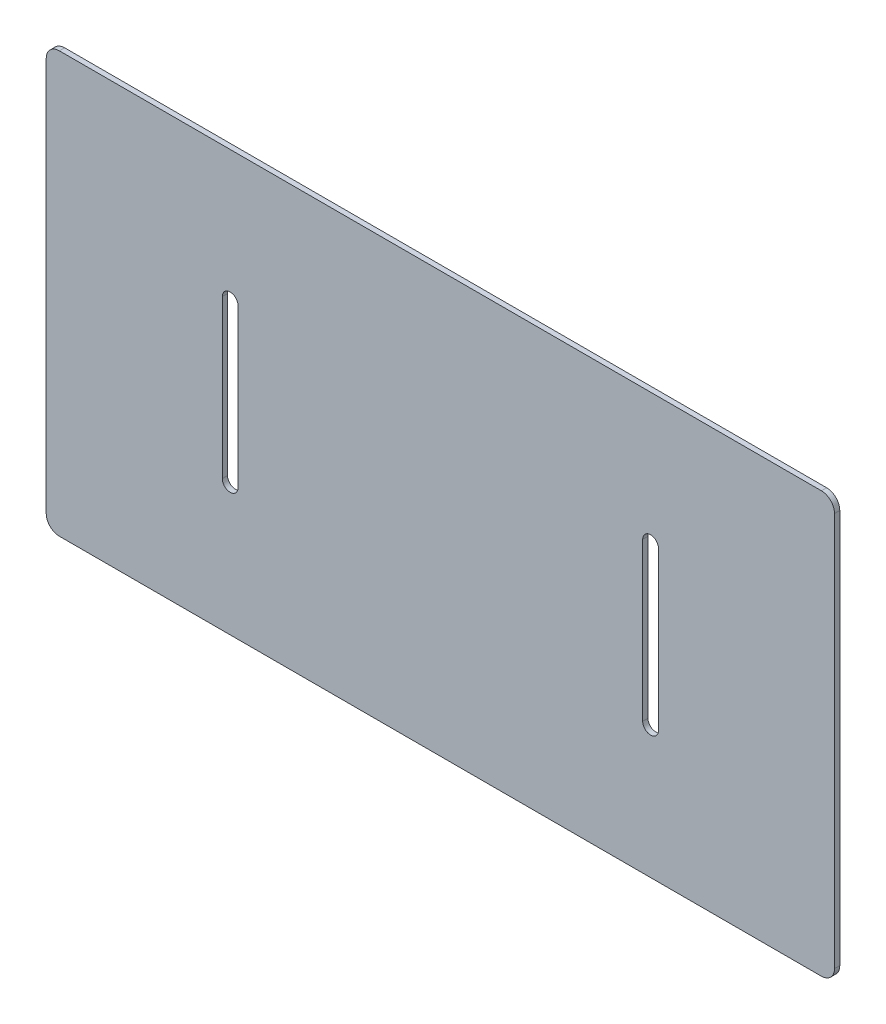
ISO-10303-21;
HEADER;
FILE_DESCRIPTION(('STEP AP214'),'2;1');
FILE_NAME('part.step','',(''),(''),'','','');
FILE_SCHEMA(('AUTOMOTIVE_DESIGN { 1 0 10303 214 1 1 1 1 }'));
ENDSEC;
DATA;
#1=APPLICATION_CONTEXT('core data for automotive mechanical design processes');
#2=APPLICATION_PROTOCOL_DEFINITION('international standard','automotive_design',2000,#1);
#3=PRODUCT_CONTEXT('',#1,'mechanical');
#4=PRODUCT('Part','Part','',(#3));
#5=PRODUCT_RELATED_PRODUCT_CATEGORY('part','',(#4));
#6=PRODUCT_DEFINITION_FORMATION('','',#4);
#7=PRODUCT_DEFINITION_CONTEXT('part definition',#1,'design');
#8=PRODUCT_DEFINITION('design','',#6,#7);
#9=PRODUCT_DEFINITION_SHAPE('','',#8);
#10=(LENGTH_UNIT() NAMED_UNIT(*) SI_UNIT(.MILLI.,.METRE.));
#11=(NAMED_UNIT(*) PLANE_ANGLE_UNIT() SI_UNIT($,.RADIAN.));
#12=(NAMED_UNIT(*) SI_UNIT($,.STERADIAN.) SOLID_ANGLE_UNIT());
#13=UNCERTAINTY_MEASURE_WITH_UNIT(LENGTH_MEASURE(1.E-05),#10,'distance_accuracy_value','');
#14=(GEOMETRIC_REPRESENTATION_CONTEXT(3) GLOBAL_UNCERTAINTY_ASSIGNED_CONTEXT((#13)) GLOBAL_UNIT_ASSIGNED_CONTEXT((#10,
#11,#12)) REPRESENTATION_CONTEXT('',''));
#15=CARTESIAN_POINT('',(0.,0.,0.));
#16=DIRECTION('',(0.,0.,1.));
#17=DIRECTION('',(1.,0.,0.));
#18=AXIS2_PLACEMENT_3D('',#15,#16,#17);
#19=CARTESIAN_POINT('',(-150.,80.,0.));
#20=DIRECTION('',(0.,-1.,0.));
#21=DIRECTION('',(-1.,0.,0.));
#22=AXIS2_PLACEMENT_3D('',#19,#20,#21);
#23=PLANE('',#22);
#24=DIRECTION('',(0.,0.,1.));
#25=VECTOR('',#24,1.);
#26=CARTESIAN_POINT('',(145.,80.,0.));
#27=LINE('',#26,#25);
#28=CARTESIAN_POINT('',(145.,80.,-2.));
#29=VERTEX_POINT('',#28);
#30=CARTESIAN_POINT('',(145.,80.,0.));
#31=VERTEX_POINT('',#30);
#32=EDGE_CURVE('E11',#29,#31,#27,.T.);
#33=ORIENTED_EDGE('',*,*,#32,.F.);
#34=DIRECTION('',(-1.,0.,0.));
#35=VECTOR('',#34,1.);
#36=CARTESIAN_POINT('',(0.,80.,-2.));
#37=LINE('',#36,#35);
#38=CARTESIAN_POINT('',(-145.,80.,-2.));
#39=VERTEX_POINT('',#38);
#40=EDGE_CURVE('E129',#29,#39,#37,.T.);
#41=ORIENTED_EDGE('',*,*,#40,.T.);
#42=DIRECTION('',(0.,0.,1.));
#43=VECTOR('',#42,1.);
#44=CARTESIAN_POINT('',(-145.,80.,0.));
#45=LINE('',#44,#43);
#46=CARTESIAN_POINT('',(-145.,80.,0.));
#47=VERTEX_POINT('',#46);
#48=EDGE_CURVE('E47',#39,#47,#45,.T.);
#49=ORIENTED_EDGE('',*,*,#48,.T.);
#50=DIRECTION('',(-1.,0.,0.));
#51=VECTOR('',#50,1.);
#52=CARTESIAN_POINT('',(-150.,80.,0.));
#53=LINE('',#52,#51);
#54=EDGE_CURVE('E197',#31,#47,#53,.T.);
#55=ORIENTED_EDGE('',*,*,#54,.F.);
#56=EDGE_LOOP('',(#33,#41,#49,#55));
#57=FACE_BOUND('',#56,.T.);
#58=ADVANCED_FACE('F37',(#57),#23,.F.);
#59=CARTESIAN_POINT('',(-145.,75.,0.));
#60=DIRECTION('',(0.,0.,-1.));
#61=DIRECTION('',(-1.,0.,0.));
#62=AXIS2_PLACEMENT_3D('',#59,#60,#61);
#63=CYLINDRICAL_SURFACE('',#62,5.);
#64=ORIENTED_EDGE('',*,*,#48,.F.);
#65=CARTESIAN_POINT('',(-145.,75.,-2.));
#66=DIRECTION('',(0.,0.,-1.));
#67=DIRECTION('',(-1.,0.,0.));
#68=AXIS2_PLACEMENT_3D('',#65,#66,#67);
#69=CIRCLE('',#68,5.);
#70=CARTESIAN_POINT('',(-150.,75.,-2.));
#71=VERTEX_POINT('',#70);
#72=EDGE_CURVE('E153',#39,#71,#69,.F.);
#73=ORIENTED_EDGE('',*,*,#72,.T.);
#74=DIRECTION('',(0.,0.,1.));
#75=VECTOR('',#74,1.);
#76=CARTESIAN_POINT('',(-150.,75.,0.));
#77=LINE('',#76,#75);
#78=CARTESIAN_POINT('',(-150.,75.,0.));
#79=VERTEX_POINT('',#78);
#80=EDGE_CURVE('E190',#71,#79,#77,.T.);
#81=ORIENTED_EDGE('',*,*,#80,.T.);
#82=CARTESIAN_POINT('',(-145.,75.,0.));
#83=DIRECTION('',(0.,0.,-1.));
#84=DIRECTION('',(-1.,0.,0.));
#85=AXIS2_PLACEMENT_3D('',#82,#83,#84);
#86=CIRCLE('',#85,5.);
#87=EDGE_CURVE('E206',#47,#79,#86,.F.);
#88=ORIENTED_EDGE('',*,*,#87,.F.);
#89=EDGE_LOOP('',(#64,#73,#81,#88));
#90=FACE_BOUND('',#89,.T.);
#91=ADVANCED_FACE('F209',(#90),#63,.T.);
#92=CARTESIAN_POINT('',(-150.,-80.,0.));
#93=DIRECTION('',(1.,0.,0.));
#94=DIRECTION('',(0.,-1.,0.));
#95=AXIS2_PLACEMENT_3D('',#92,#93,#94);
#96=PLANE('',#95);
#97=ORIENTED_EDGE('',*,*,#80,.F.);
#98=DIRECTION('',(0.,1.,0.));
#99=VECTOR('',#98,1.);
#100=CARTESIAN_POINT('',(-150.,0.,-2.));
#101=LINE('',#100,#99);
#102=CARTESIAN_POINT('',(-150.,-75.,-2.));
#103=VERTEX_POINT('',#102);
#104=EDGE_CURVE('E150',#71,#103,#101,.F.);
#105=ORIENTED_EDGE('',*,*,#104,.T.);
#106=DIRECTION('',(0.,0.,1.));
#107=VECTOR('',#106,1.);
#108=CARTESIAN_POINT('',(-150.,-75.,0.));
#109=LINE('',#108,#107);
#110=CARTESIAN_POINT('',(-150.,-75.,0.));
#111=VERTEX_POINT('',#110);
#112=EDGE_CURVE('E187',#103,#111,#109,.T.);
#113=ORIENTED_EDGE('',*,*,#112,.T.);
#114=DIRECTION('',(0.,-1.,0.));
#115=VECTOR('',#114,1.);
#116=CARTESIAN_POINT('',(-150.,-80.,0.));
#117=LINE('',#116,#115);
#118=EDGE_CURVE('E210',#79,#111,#117,.T.);
#119=ORIENTED_EDGE('',*,*,#118,.F.);
#120=EDGE_LOOP('',(#97,#105,#113,#119));
#121=FACE_BOUND('',#120,.T.);
#122=ADVANCED_FACE('F337',(#121),#96,.F.);
#123=CARTESIAN_POINT('',(-145.,-75.,0.));
#124=DIRECTION('',(0.,0.,-1.));
#125=DIRECTION('',(-1.,0.,0.));
#126=AXIS2_PLACEMENT_3D('',#123,#124,#125);
#127=CYLINDRICAL_SURFACE('',#126,5.);
#128=ORIENTED_EDGE('',*,*,#112,.F.);
#129=CARTESIAN_POINT('',(-145.,-75.,-2.));
#130=DIRECTION('',(0.,0.,-1.));
#131=DIRECTION('',(-1.,0.,0.));
#132=AXIS2_PLACEMENT_3D('',#129,#130,#131);
#133=CIRCLE('',#132,5.);
#134=CARTESIAN_POINT('',(-145.,-80.,-2.));
#135=VERTEX_POINT('',#134);
#136=EDGE_CURVE('E147',#103,#135,#133,.F.);
#137=ORIENTED_EDGE('',*,*,#136,.T.);
#138=DIRECTION('',(0.,0.,1.));
#139=VECTOR('',#138,1.);
#140=CARTESIAN_POINT('',(-145.,-80.,0.));
#141=LINE('',#140,#139);
#142=CARTESIAN_POINT('',(-145.,-80.,0.));
#143=VERTEX_POINT('',#142);
#144=EDGE_CURVE('E184',#135,#143,#141,.T.);
#145=ORIENTED_EDGE('',*,*,#144,.T.);
#146=CARTESIAN_POINT('',(-145.,-75.,0.));
#147=DIRECTION('',(0.,0.,-1.));
#148=DIRECTION('',(-1.,0.,0.));
#149=AXIS2_PLACEMENT_3D('',#146,#147,#148);
#150=CIRCLE('',#149,5.);
#151=EDGE_CURVE('E212',#111,#143,#150,.F.);
#152=ORIENTED_EDGE('',*,*,#151,.F.);
#153=EDGE_LOOP('',(#128,#137,#145,#152));
#154=FACE_BOUND('',#153,.T.);
#155=ADVANCED_FACE('F269',(#154),#127,.T.);
#156=CARTESIAN_POINT('',(-150.,-80.,0.));
#157=DIRECTION('',(0.,1.,0.));
#158=DIRECTION('',(1.,0.,0.));
#159=AXIS2_PLACEMENT_3D('',#156,#157,#158);
#160=PLANE('',#159);
#161=ORIENTED_EDGE('',*,*,#144,.F.);
#162=DIRECTION('',(-1.,0.,0.));
#163=VECTOR('',#162,1.);
#164=CARTESIAN_POINT('',(0.,-80.,-2.));
#165=LINE('',#164,#163);
#166=CARTESIAN_POINT('',(145.,-80.,-2.));
#167=VERTEX_POINT('',#166);
#168=EDGE_CURVE('E144',#135,#167,#165,.F.);
#169=ORIENTED_EDGE('',*,*,#168,.T.);
#170=DIRECTION('',(0.,0.,1.));
#171=VECTOR('',#170,1.);
#172=CARTESIAN_POINT('',(145.,-80.,0.));
#173=LINE('',#172,#171);
#174=CARTESIAN_POINT('',(145.,-80.,0.));
#175=VERTEX_POINT('',#174);
#176=EDGE_CURVE('E182',#167,#175,#173,.T.);
#177=ORIENTED_EDGE('',*,*,#176,.T.);
#178=DIRECTION('',(1.,0.,0.));
#179=VECTOR('',#178,1.);
#180=CARTESIAN_POINT('',(-150.,-80.,0.));
#181=LINE('',#180,#179);
#182=EDGE_CURVE('E218',#143,#175,#181,.T.);
#183=ORIENTED_EDGE('',*,*,#182,.F.);
#184=EDGE_LOOP('',(#161,#169,#177,#183));
#185=FACE_BOUND('',#184,.T.);
#186=ADVANCED_FACE('F274',(#185),#160,.F.);
#187=CARTESIAN_POINT('',(145.,-75.,0.));
#188=DIRECTION('',(0.,0.,-1.));
#189=DIRECTION('',(-1.,0.,0.));
#190=AXIS2_PLACEMENT_3D('',#187,#188,#189);
#191=CYLINDRICAL_SURFACE('',#190,5.);
#192=ORIENTED_EDGE('',*,*,#176,.F.);
#193=CARTESIAN_POINT('',(145.,-75.,-2.));
#194=DIRECTION('',(0.,0.,-1.));
#195=DIRECTION('',(-1.,0.,0.));
#196=AXIS2_PLACEMENT_3D('',#193,#194,#195);
#197=CIRCLE('',#196,5.);
#198=CARTESIAN_POINT('',(150.,-75.,-2.));
#199=VERTEX_POINT('',#198);
#200=EDGE_CURVE('E141',#167,#199,#197,.F.);
#201=ORIENTED_EDGE('',*,*,#200,.T.);
#202=DIRECTION('',(0.,0.,1.));
#203=VECTOR('',#202,1.);
#204=CARTESIAN_POINT('',(150.,-75.,0.));
#205=LINE('',#204,#203);
#206=CARTESIAN_POINT('',(150.,-75.,0.));
#207=VERTEX_POINT('',#206);
#208=EDGE_CURVE('E55',#199,#207,#205,.T.);
#209=ORIENTED_EDGE('',*,*,#208,.T.);
#210=CARTESIAN_POINT('',(145.,-75.,0.));
#211=DIRECTION('',(0.,0.,-1.));
#212=DIRECTION('',(-1.,0.,0.));
#213=AXIS2_PLACEMENT_3D('',#210,#211,#212);
#214=CIRCLE('',#213,5.);
#215=EDGE_CURVE('E170',#175,#207,#214,.F.);
#216=ORIENTED_EDGE('',*,*,#215,.F.);
#217=EDGE_LOOP('',(#192,#201,#209,#216));
#218=FACE_BOUND('',#217,.T.);
#219=ADVANCED_FACE('F275',(#218),#191,.T.);
#220=CARTESIAN_POINT('',(150.,-80.,0.));
#221=DIRECTION('',(-1.,0.,0.));
#222=DIRECTION('',(0.,1.,0.));
#223=AXIS2_PLACEMENT_3D('',#220,#221,#222);
#224=PLANE('',#223);
#225=ORIENTED_EDGE('',*,*,#208,.F.);
#226=DIRECTION('',(0.,1.,0.));
#227=VECTOR('',#226,1.);
#228=CARTESIAN_POINT('',(150.,0.,-2.));
#229=LINE('',#228,#227);
#230=CARTESIAN_POINT('',(150.,75.,-2.));
#231=VERTEX_POINT('',#230);
#232=EDGE_CURVE('E127',#199,#231,#229,.T.);
#233=ORIENTED_EDGE('',*,*,#232,.T.);
#234=DIRECTION('',(0.,0.,1.));
#235=VECTOR('',#234,1.);
#236=CARTESIAN_POINT('',(150.,75.,0.));
#237=LINE('',#236,#235);
#238=CARTESIAN_POINT('',(150.,75.,0.));
#239=VERTEX_POINT('',#238);
#240=EDGE_CURVE('E41',#231,#239,#237,.T.);
#241=ORIENTED_EDGE('',*,*,#240,.T.);
#242=DIRECTION('',(0.,1.,0.));
#243=VECTOR('',#242,1.);
#244=CARTESIAN_POINT('',(150.,-80.,0.));
#245=LINE('',#244,#243);
#246=EDGE_CURVE('E276',#207,#239,#245,.T.);
#247=ORIENTED_EDGE('',*,*,#246,.F.);
#248=EDGE_LOOP('',(#225,#233,#241,#247));
#249=FACE_BOUND('',#248,.T.);
#250=ADVANCED_FACE('F131',(#249),#224,.F.);
#251=CARTESIAN_POINT('',(77.,30.,0.));
#252=DIRECTION('',(1.,0.,0.));
#253=DIRECTION('',(0.,-1.,0.));
#254=AXIS2_PLACEMENT_3D('',#251,#252,#253);
#255=PLANE('',#254);
#256=DIRECTION('',(0.,0.,1.));
#257=VECTOR('',#256,1.);
#258=CARTESIAN_POINT('',(77.,-30.,0.));
#259=LINE('',#258,#257);
#260=CARTESIAN_POINT('',(77.,-30.,-2.));
#261=VERTEX_POINT('',#260);
#262=CARTESIAN_POINT('',(77.,-30.,0.));
#263=VERTEX_POINT('',#262);
#264=EDGE_CURVE('E122',#261,#263,#259,.T.);
#265=ORIENTED_EDGE('',*,*,#264,.F.);
#266=DIRECTION('',(0.,1.,0.));
#267=VECTOR('',#266,1.);
#268=CARTESIAN_POINT('',(77.,0.,-2.));
#269=LINE('',#268,#267);
#270=CARTESIAN_POINT('',(77.,30.,-2.));
#271=VERTEX_POINT('',#270);
#272=EDGE_CURVE('E135',#271,#261,#269,.F.);
#273=ORIENTED_EDGE('',*,*,#272,.F.);
#274=DIRECTION('',(0.,0.,1.));
#275=VECTOR('',#274,1.);
#276=CARTESIAN_POINT('',(77.,30.,0.));
#277=LINE('',#276,#275);
#278=CARTESIAN_POINT('',(77.,30.,0.));
#279=VERTEX_POINT('',#278);
#280=EDGE_CURVE('E174',#271,#279,#277,.T.);
#281=ORIENTED_EDGE('',*,*,#280,.T.);
#282=DIRECTION('',(0.,-1.,0.));
#283=VECTOR('',#282,1.);
#284=CARTESIAN_POINT('',(77.,30.,0.));
#285=LINE('',#284,#283);
#286=EDGE_CURVE('E278',#279,#263,#285,.T.);
#287=ORIENTED_EDGE('',*,*,#286,.T.);
#288=EDGE_LOOP('',(#265,#273,#281,#287));
#289=FACE_BOUND('',#288,.T.);
#290=ADVANCED_FACE('F323',(#289),#255,.T.);
#291=CARTESIAN_POINT('',(80.,30.,0.));
#292=DIRECTION('',(0.,0.,-1.));
#293=DIRECTION('',(-1.,0.,0.));
#294=AXIS2_PLACEMENT_3D('',#291,#292,#293);
#295=CYLINDRICAL_SURFACE('',#294,3.);
#296=ORIENTED_EDGE('',*,*,#280,.F.);
#297=CARTESIAN_POINT('',(80.,30.,-2.));
#298=DIRECTION('',(0.,0.,1.));
#299=DIRECTION('',(1.,0.,0.));
#300=AXIS2_PLACEMENT_3D('',#297,#298,#299);
#301=CIRCLE('',#300,3.);
#302=CARTESIAN_POINT('',(83.,30.,-2.));
#303=VERTEX_POINT('',#302);
#304=EDGE_CURVE('E132',#303,#271,#301,.T.);
#305=ORIENTED_EDGE('',*,*,#304,.F.);
#306=DIRECTION('',(0.,0.,1.));
#307=VECTOR('',#306,1.);
#308=CARTESIAN_POINT('',(83.,30.,0.));
#309=LINE('',#308,#307);
#310=CARTESIAN_POINT('',(83.,30.,0.));
#311=VERTEX_POINT('',#310);
#312=EDGE_CURVE('E171',#303,#311,#309,.T.);
#313=ORIENTED_EDGE('',*,*,#312,.T.);
#314=CARTESIAN_POINT('',(80.,30.,0.));
#315=DIRECTION('',(0.,0.,1.));
#316=DIRECTION('',(-1.,0.,0.));
#317=AXIS2_PLACEMENT_3D('',#314,#315,#316);
#318=CIRCLE('',#317,3.);
#319=EDGE_CURVE('E257',#311,#279,#318,.T.);
#320=ORIENTED_EDGE('',*,*,#319,.T.);
#321=EDGE_LOOP('',(#296,#305,#313,#320));
#322=FACE_BOUND('',#321,.T.);
#323=ADVANCED_FACE('F255',(#322),#295,.F.);
#324=CARTESIAN_POINT('',(83.,30.,0.));
#325=DIRECTION('',(-1.,0.,0.));
#326=DIRECTION('',(0.,1.,0.));
#327=AXIS2_PLACEMENT_3D('',#324,#325,#326);
#328=PLANE('',#327);
#329=ORIENTED_EDGE('',*,*,#312,.F.);
#330=DIRECTION('',(0.,1.,0.));
#331=VECTOR('',#330,1.);
#332=CARTESIAN_POINT('',(83.,0.,-2.));
#333=LINE('',#332,#331);
#334=CARTESIAN_POINT('',(83.,-30.,-2.));
#335=VERTEX_POINT('',#334);
#336=EDGE_CURVE('E230',#335,#303,#333,.T.);
#337=ORIENTED_EDGE('',*,*,#336,.F.);
#338=DIRECTION('',(0.,0.,1.));
#339=VECTOR('',#338,1.);
#340=CARTESIAN_POINT('',(83.,-30.,0.));
#341=LINE('',#340,#339);
#342=CARTESIAN_POINT('',(83.,-30.,0.));
#343=VERTEX_POINT('',#342);
#344=EDGE_CURVE('E167',#335,#343,#341,.T.);
#345=ORIENTED_EDGE('',*,*,#344,.T.);
#346=DIRECTION('',(0.,1.,0.));
#347=VECTOR('',#346,1.);
#348=CARTESIAN_POINT('',(83.,30.,0.));
#349=LINE('',#348,#347);
#350=EDGE_CURVE('E251',#343,#311,#349,.T.);
#351=ORIENTED_EDGE('',*,*,#350,.T.);
#352=EDGE_LOOP('',(#329,#337,#345,#351));
#353=FACE_BOUND('',#352,.T.);
#354=ADVANCED_FACE('F246',(#353),#328,.T.);
#355=CARTESIAN_POINT('',(-77.,30.,0.));
#356=DIRECTION('',(-1.,0.,0.));
#357=DIRECTION('',(0.,1.,0.));
#358=AXIS2_PLACEMENT_3D('',#355,#356,#357);
#359=PLANE('',#358);
#360=DIRECTION('',(0.,0.,1.));
#361=VECTOR('',#360,1.);
#362=CARTESIAN_POINT('',(-77.,30.,0.));
#363=LINE('',#362,#361);
#364=CARTESIAN_POINT('',(-77.,30.,-2.));
#365=VERTEX_POINT('',#364);
#366=CARTESIAN_POINT('',(-77.,30.,0.));
#367=VERTEX_POINT('',#366);
#368=EDGE_CURVE('E164',#365,#367,#363,.T.);
#369=ORIENTED_EDGE('',*,*,#368,.F.);
#370=DIRECTION('',(0.,1.,0.));
#371=VECTOR('',#370,1.);
#372=CARTESIAN_POINT('',(-77.,0.,-2.));
#373=LINE('',#372,#371);
#374=CARTESIAN_POINT('',(-77.,-30.,-2.));
#375=VERTEX_POINT('',#374);
#376=EDGE_CURVE('E231',#375,#365,#373,.T.);
#377=ORIENTED_EDGE('',*,*,#376,.F.);
#378=DIRECTION('',(0.,0.,1.));
#379=VECTOR('',#378,1.);
#380=CARTESIAN_POINT('',(-77.,-30.,0.));
#381=LINE('',#380,#379);
#382=CARTESIAN_POINT('',(-77.,-30.,0.));
#383=VERTEX_POINT('',#382);
#384=EDGE_CURVE('E160',#375,#383,#381,.T.);
#385=ORIENTED_EDGE('',*,*,#384,.T.);
#386=DIRECTION('',(0.,1.,0.));
#387=VECTOR('',#386,1.);
#388=CARTESIAN_POINT('',(-77.,30.,0.));
#389=LINE('',#388,#387);
#390=EDGE_CURVE('E290',#383,#367,#389,.T.);
#391=ORIENTED_EDGE('',*,*,#390,.T.);
#392=EDGE_LOOP('',(#369,#377,#385,#391));
#393=FACE_BOUND('',#392,.T.);
#394=ADVANCED_FACE('F363',(#393),#359,.T.);
#395=CARTESIAN_POINT('',(-80.,-30.,0.));
#396=DIRECTION('',(0.,0.,-1.));
#397=DIRECTION('',(-1.,0.,0.));
#398=AXIS2_PLACEMENT_3D('',#395,#396,#397);
#399=CYLINDRICAL_SURFACE('',#398,2.99999999999999);
#400=ORIENTED_EDGE('',*,*,#384,.F.);
#401=CARTESIAN_POINT('',(-80.,-30.,-2.));
#402=DIRECTION('',(0.,0.,1.));
#403=DIRECTION('',(1.,0.,0.));
#404=AXIS2_PLACEMENT_3D('',#401,#402,#403);
#405=CIRCLE('',#404,2.99999999999999);
#406=CARTESIAN_POINT('',(-83.,-30.,-2.));
#407=VERTEX_POINT('',#406);
#408=EDGE_CURVE('E227',#407,#375,#405,.T.);
#409=ORIENTED_EDGE('',*,*,#408,.F.);
#410=DIRECTION('',(0.,0.,1.));
#411=VECTOR('',#410,1.);
#412=CARTESIAN_POINT('',(-83.,-30.,0.));
#413=LINE('',#412,#411);
#414=CARTESIAN_POINT('',(-83.,-30.,0.));
#415=VERTEX_POINT('',#414);
#416=EDGE_CURVE('E157',#407,#415,#413,.T.);
#417=ORIENTED_EDGE('',*,*,#416,.T.);
#418=CARTESIAN_POINT('',(-80.,-30.,0.));
#419=DIRECTION('',(0.,0.,1.));
#420=DIRECTION('',(1.,0.,0.));
#421=AXIS2_PLACEMENT_3D('',#418,#419,#420);
#422=CIRCLE('',#421,2.99999999999999);
#423=EDGE_CURVE('E287',#415,#383,#422,.T.);
#424=ORIENTED_EDGE('',*,*,#423,.T.);
#425=EDGE_LOOP('',(#400,#409,#417,#424));
#426=FACE_BOUND('',#425,.T.);
#427=ADVANCED_FACE('F310',(#426),#399,.F.);
#428=CARTESIAN_POINT('',(-83.,30.,0.));
#429=DIRECTION('',(1.,0.,0.));
#430=DIRECTION('',(0.,-1.,0.));
#431=AXIS2_PLACEMENT_3D('',#428,#429,#430);
#432=PLANE('',#431);
#433=ORIENTED_EDGE('',*,*,#416,.F.);
#434=DIRECTION('',(0.,1.,0.));
#435=VECTOR('',#434,1.);
#436=CARTESIAN_POINT('',(-83.,0.,-2.));
#437=LINE('',#436,#435);
#438=CARTESIAN_POINT('',(-83.,30.,-2.));
#439=VERTEX_POINT('',#438);
#440=EDGE_CURVE('E223',#439,#407,#437,.F.);
#441=ORIENTED_EDGE('',*,*,#440,.F.);
#442=DIRECTION('',(0.,0.,1.));
#443=VECTOR('',#442,1.);
#444=CARTESIAN_POINT('',(-83.,30.,0.));
#445=LINE('',#444,#443);
#446=CARTESIAN_POINT('',(-83.,30.,0.));
#447=VERTEX_POINT('',#446);
#448=EDGE_CURVE('E161',#439,#447,#445,.T.);
#449=ORIENTED_EDGE('',*,*,#448,.T.);
#450=DIRECTION('',(0.,-1.,0.));
#451=VECTOR('',#450,1.);
#452=CARTESIAN_POINT('',(-83.,30.,0.));
#453=LINE('',#452,#451);
#454=EDGE_CURVE('E143',#447,#415,#453,.T.);
#455=ORIENTED_EDGE('',*,*,#454,.T.);
#456=EDGE_LOOP('',(#433,#441,#449,#455));
#457=FACE_BOUND('',#456,.T.);
#458=ADVANCED_FACE('F301',(#457),#432,.T.);
#459=CARTESIAN_POINT('',(-80.,30.,0.));
#460=DIRECTION('',(0.,0.,-1.));
#461=DIRECTION('',(-1.,0.,0.));
#462=AXIS2_PLACEMENT_3D('',#459,#460,#461);
#463=CYLINDRICAL_SURFACE('',#462,3.);
#464=CARTESIAN_POINT('',(-80.,30.,-2.));
#465=DIRECTION('',(0.,0.,1.));
#466=DIRECTION('',(1.,0.,0.));
#467=AXIS2_PLACEMENT_3D('',#464,#465,#466);
#468=CIRCLE('',#467,3.);
#469=EDGE_CURVE('E226',#365,#439,#468,.T.);
#470=ORIENTED_EDGE('',*,*,#469,.F.);
#471=ORIENTED_EDGE('',*,*,#368,.T.);
#472=CARTESIAN_POINT('',(-80.,30.,0.));
#473=DIRECTION('',(0.,0.,1.));
#474=DIRECTION('',(1.,0.,0.));
#475=AXIS2_PLACEMENT_3D('',#472,#473,#474);
#476=CIRCLE('',#475,3.);
#477=EDGE_CURVE('E293',#367,#447,#476,.T.);
#478=ORIENTED_EDGE('',*,*,#477,.T.);
#479=ORIENTED_EDGE('',*,*,#448,.F.);
#480=EDGE_LOOP('',(#470,#471,#478,#479));
#481=FACE_BOUND('',#480,.T.);
#482=ADVANCED_FACE('F349',(#481),#463,.F.);
#483=CARTESIAN_POINT('',(80.,-30.,0.));
#484=DIRECTION('',(0.,0.,-1.));
#485=DIRECTION('',(-1.,0.,0.));
#486=AXIS2_PLACEMENT_3D('',#483,#484,#485);
#487=CYLINDRICAL_SURFACE('',#486,2.99999999999999);
#488=CARTESIAN_POINT('',(80.,-30.,-2.));
#489=DIRECTION('',(0.,0.,1.));
#490=DIRECTION('',(1.,0.,0.));
#491=AXIS2_PLACEMENT_3D('',#488,#489,#490);
#492=CIRCLE('',#491,2.99999999999999);
#493=EDGE_CURVE('E139',#261,#335,#492,.T.);
#494=ORIENTED_EDGE('',*,*,#493,.F.);
#495=ORIENTED_EDGE('',*,*,#264,.T.);
#496=CARTESIAN_POINT('',(80.,-30.,0.));
#497=DIRECTION('',(0.,0.,1.));
#498=DIRECTION('',(-1.,0.,0.));
#499=AXIS2_PLACEMENT_3D('',#496,#497,#498);
#500=CIRCLE('',#499,2.99999999999999);
#501=EDGE_CURVE('E283',#263,#343,#500,.T.);
#502=ORIENTED_EDGE('',*,*,#501,.T.);
#503=ORIENTED_EDGE('',*,*,#344,.F.);
#504=EDGE_LOOP('',(#494,#495,#502,#503));
#505=FACE_BOUND('',#504,.T.);
#506=ADVANCED_FACE('F320',(#505),#487,.F.);
#507=CARTESIAN_POINT('',(145.,75.,0.));
#508=DIRECTION('',(0.,0.,-1.));
#509=DIRECTION('',(-1.,0.,0.));
#510=AXIS2_PLACEMENT_3D('',#507,#508,#509);
#511=CYLINDRICAL_SURFACE('',#510,5.);
#512=CARTESIAN_POINT('',(145.,75.,-2.));
#513=DIRECTION('',(0.,0.,-1.));
#514=DIRECTION('',(-1.,0.,0.));
#515=AXIS2_PLACEMENT_3D('',#512,#513,#514);
#516=CIRCLE('',#515,5.);
#517=EDGE_CURVE('E115',#231,#29,#516,.F.);
#518=ORIENTED_EDGE('',*,*,#517,.T.);
#519=ORIENTED_EDGE('',*,*,#32,.T.);
#520=CARTESIAN_POINT('',(145.,75.,0.));
#521=DIRECTION('',(0.,0.,-1.));
#522=DIRECTION('',(-1.,0.,0.));
#523=AXIS2_PLACEMENT_3D('',#520,#521,#522);
#524=CIRCLE('',#523,5.);
#525=EDGE_CURVE('E118',#239,#31,#524,.F.);
#526=ORIENTED_EDGE('',*,*,#525,.F.);
#527=ORIENTED_EDGE('',*,*,#240,.F.);
#528=EDGE_LOOP('',(#518,#519,#526,#527));
#529=FACE_BOUND('',#528,.T.);
#530=ADVANCED_FACE('F39',(#529),#511,.T.);
#531=CARTESIAN_POINT('',(0.,0.,0.));
#532=DIRECTION('',(0.,0.,-1.));
#533=DIRECTION('',(-1.,0.,0.));
#534=AXIS2_PLACEMENT_3D('',#531,#532,#533);
#535=PLANE('',#534);
#536=ORIENTED_EDGE('',*,*,#454,.F.);
#537=ORIENTED_EDGE('',*,*,#477,.F.);
#538=ORIENTED_EDGE('',*,*,#390,.F.);
#539=ORIENTED_EDGE('',*,*,#423,.F.);
#540=EDGE_LOOP('',(#536,#537,#538,#539));
#541=FACE_BOUND('',#540,.T.);
#542=ORIENTED_EDGE('',*,*,#350,.F.);
#543=ORIENTED_EDGE('',*,*,#501,.F.);
#544=ORIENTED_EDGE('',*,*,#286,.F.);
#545=ORIENTED_EDGE('',*,*,#319,.F.);
#546=EDGE_LOOP('',(#542,#543,#544,#545));
#547=FACE_BOUND('',#546,.T.);
#548=ORIENTED_EDGE('',*,*,#246,.T.);
#549=ORIENTED_EDGE('',*,*,#525,.T.);
#550=ORIENTED_EDGE('',*,*,#54,.T.);
#551=ORIENTED_EDGE('',*,*,#87,.T.);
#552=ORIENTED_EDGE('',*,*,#118,.T.);
#553=ORIENTED_EDGE('',*,*,#151,.T.);
#554=ORIENTED_EDGE('',*,*,#182,.T.);
#555=ORIENTED_EDGE('',*,*,#215,.T.);
#556=EDGE_LOOP('',(#548,#549,#550,#551,#552,#553,#554,#555));
#557=FACE_BOUND('',#556,.T.);
#558=ADVANCED_FACE('F204',(#541,#547,#557),#535,.F.);
#559=CARTESIAN_POINT('',(0.,0.,-2.));
#560=DIRECTION('',(0.,0.,-1.));
#561=DIRECTION('',(-1.,0.,0.));
#562=AXIS2_PLACEMENT_3D('',#559,#560,#561);
#563=PLANE('',#562);
#564=ORIENTED_EDGE('',*,*,#440,.T.);
#565=ORIENTED_EDGE('',*,*,#408,.T.);
#566=ORIENTED_EDGE('',*,*,#376,.T.);
#567=ORIENTED_EDGE('',*,*,#469,.T.);
#568=EDGE_LOOP('',(#564,#565,#566,#567));
#569=FACE_BOUND('',#568,.T.);
#570=ORIENTED_EDGE('',*,*,#336,.T.);
#571=ORIENTED_EDGE('',*,*,#304,.T.);
#572=ORIENTED_EDGE('',*,*,#272,.T.);
#573=ORIENTED_EDGE('',*,*,#493,.T.);
#574=EDGE_LOOP('',(#570,#571,#572,#573));
#575=FACE_BOUND('',#574,.T.);
#576=ORIENTED_EDGE('',*,*,#232,.F.);
#577=ORIENTED_EDGE('',*,*,#200,.F.);
#578=ORIENTED_EDGE('',*,*,#168,.F.);
#579=ORIENTED_EDGE('',*,*,#136,.F.);
#580=ORIENTED_EDGE('',*,*,#104,.F.);
#581=ORIENTED_EDGE('',*,*,#72,.F.);
#582=ORIENTED_EDGE('',*,*,#40,.F.);
#583=ORIENTED_EDGE('',*,*,#517,.F.);
#584=EDGE_LOOP('',(#576,#577,#578,#579,#580,#581,#582,#583));
#585=FACE_BOUND('',#584,.T.);
#586=ADVANCED_FACE('F125',(#569,#575,#585),#563,.T.);
#587=CLOSED_SHELL('',(#58,#91,#122,#155,#186,#219,#250,#290,#323,#354,#394,#427,#458,#482,#506,
#530,#558,#586));
#588=MANIFOLD_SOLID_BREP('B2',#587);
#589=ADVANCED_BREP_SHAPE_REPRESENTATION('',(#18,#588),#14);
#590=SHAPE_DEFINITION_REPRESENTATION(#9,#589);
ENDSEC;
END-ISO-10303-21;
